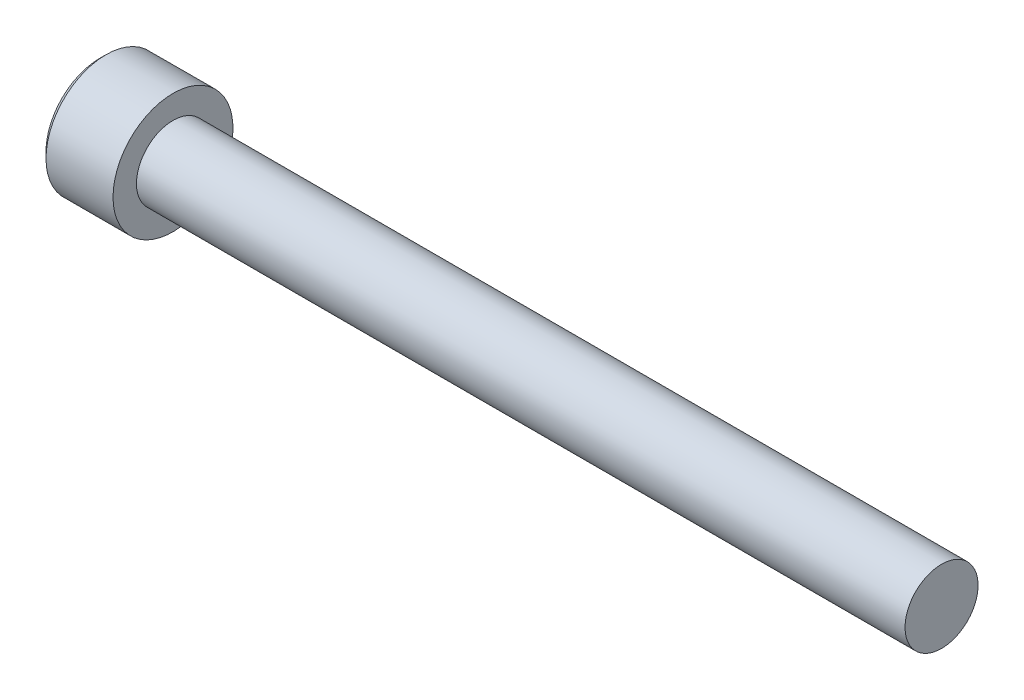
ISO-10303-21;
HEADER;
FILE_DESCRIPTION(('STEP AP214'),'2;1');
FILE_NAME('part.step','',(''),(''),'','','');
FILE_SCHEMA(('AUTOMOTIVE_DESIGN { 1 0 10303 214 1 1 1 1 }'));
ENDSEC;
DATA;
#1=APPLICATION_CONTEXT('core data for automotive mechanical design processes');
#2=APPLICATION_PROTOCOL_DEFINITION('international standard','automotive_design',2000,#1);
#3=PRODUCT_CONTEXT('',#1,'mechanical');
#4=PRODUCT('Part','Part','',(#3));
#5=PRODUCT_RELATED_PRODUCT_CATEGORY('part','',(#4));
#6=PRODUCT_DEFINITION_FORMATION('','',#4);
#7=PRODUCT_DEFINITION_CONTEXT('part definition',#1,'design');
#8=PRODUCT_DEFINITION('design','',#6,#7);
#9=PRODUCT_DEFINITION_SHAPE('','',#8);
#10=(LENGTH_UNIT() NAMED_UNIT(*) SI_UNIT(.MILLI.,.METRE.));
#11=(NAMED_UNIT(*) PLANE_ANGLE_UNIT() SI_UNIT($,.RADIAN.));
#12=(NAMED_UNIT(*) SI_UNIT($,.STERADIAN.) SOLID_ANGLE_UNIT());
#13=UNCERTAINTY_MEASURE_WITH_UNIT(LENGTH_MEASURE(1.E-05),#10,'distance_accuracy_value','');
#14=(GEOMETRIC_REPRESENTATION_CONTEXT(3) GLOBAL_UNCERTAINTY_ASSIGNED_CONTEXT((#13)) GLOBAL_UNIT_ASSIGNED_CONTEXT((#10,
#11,#12)) REPRESENTATION_CONTEXT('',''));
#15=CARTESIAN_POINT('',(0.,0.,0.));
#16=DIRECTION('',(0.,0.,1.));
#17=DIRECTION('',(1.,0.,0.));
#18=AXIS2_PLACEMENT_3D('',#15,#16,#17);
#19=CARTESIAN_POINT('',(-2.28600000000007,-1.14567944042317,1.984375));
#20=DIRECTION('',(0.,0.,1.));
#21=DIRECTION('',(1.,0.,0.));
#22=AXIS2_PLACEMENT_3D('',#19,#20,#21);
#23=PLANE('',#22);
#24=CARTESIAN_POINT('',(-4.82599999995852,1.14567944044653,1.98437499999554));
#25=CARTESIAN_POINT('',(-4.78691618362732,1.06743880343266,1.9843749999984));
#26=CARTESIAN_POINT('',(-4.75011447684892,0.987898318960917,1.98437499999957));
#27=CARTESIAN_POINT('',(-4.68265620500518,0.825677042028778,1.98437500000043));
#28=CARTESIAN_POINT('',(-4.65204056061138,0.742979382529199,1.98437500000012));
#29=CARTESIAN_POINT('',(-4.5991739228306,0.575193959555969,1.98437499999988));
#30=CARTESIAN_POINT('',(-4.57689462080725,0.490115359117279,1.98437499999997));
#31=CARTESIAN_POINT('',(-4.54259467221837,0.318093091130193,1.98437500000003));
#32=CARTESIAN_POINT('',(-4.5305423022885,0.231156054976726,1.984375));
#33=CARTESIAN_POINT('',(-4.52249110263747,0.119918521511051,1.984375));
#34=CARTESIAN_POINT('',(-4.52118947557477,0.0959468443046798,1.984375));
#35=CARTESIAN_POINT('',(-4.51945182629813,0.0479845644411998,1.984375));
#36=CARTESIAN_POINT('',(-4.51901533386223,0.0239939791589393,1.984375));
#37=CARTESIAN_POINT('',(-4.51901809008399,-0.0602201717457363,1.984375));
#38=CARTESIAN_POINT('',(-4.52177452299902,-0.120461721905447,1.984375));
#39=CARTESIAN_POINT('',(-4.5326365512493,-0.240474970989197,1.984375));
#40=CARTESIAN_POINT('',(-4.54074587749718,-0.300246312758427,1.984375));
#41=CARTESIAN_POINT('',(-4.57259622946939,-0.478763752804282,1.984375));
#42=CARTESIAN_POINT('',(-4.60385422611702,-0.596208828937734,1.984375));
#43=CARTESIAN_POINT('',(-4.66780003592237,-0.785921487441256,1.984375));
#44=CARTESIAN_POINT('',(-4.69623457768558,-0.859734609866899,1.984375));
#45=CARTESIAN_POINT('',(-4.75786140400812,-1.00456595519282,1.984375));
#46=CARTESIAN_POINT('',(-4.79100779300359,-1.07560356657101,1.984375));
#47=CARTESIAN_POINT('',(-4.82599999995643,-1.14567944044724,1.984375));
#48=B_SPLINE_CURVE_WITH_KNOTS('',3,(#24,#25,#26,#27,#28,#29,#30,#31,#32,#33,#34,#35,#36,#37,#38,
#39,#40,#41,#42,#43,#44,#45,#46,#47),.UNSPECIFIED.,.F.,.F.,(4,2,2,2,2,2,2,2,2,2,2,4),(0.,
0.262559005207405,0.526801735838036,0.790138824405318,1.05265603861765,1.12466619182083,
1.19663719499031,1.3772702672652,1.55802937209382,1.92104085090328,2.15819130092264,
2.39317265078575),.UNSPECIFIED.);
#49=CARTESIAN_POINT('',(-4.82599999996829,1.14567944041753,1.98437500003084));
#50=VERTEX_POINT('',#49);
#51=CARTESIAN_POINT('',(-4.8259999999622,-1.14567944043207,1.98437500001542));
#52=VERTEX_POINT('',#51);
#53=EDGE_CURVE('E20',#50,#52,#48,.T.);
#54=ORIENTED_EDGE('',*,*,#53,.F.);
#55=DIRECTION('',(1.,0.,0.));
#56=VECTOR('',#55,1.);
#57=CARTESIAN_POINT('',(-2.28600000000007,1.14567944042316,1.984375));
#58=LINE('',#57,#56);
#59=CARTESIAN_POINT('',(-2.28600000000007,1.14567944042316,1.984375));
#60=VERTEX_POINT('',#59);
#61=EDGE_CURVE('E68',#50,#60,#58,.T.);
#62=ORIENTED_EDGE('',*,*,#61,.T.);
#63=DIRECTION('',(0.,1.,0.));
#64=VECTOR('',#63,1.);
#65=CARTESIAN_POINT('',(-2.28600000000007,0.,1.984375));
#66=LINE('',#65,#64);
#67=CARTESIAN_POINT('',(-2.28600000000007,-1.14567944042317,1.984375));
#68=VERTEX_POINT('',#67);
#69=EDGE_CURVE('E74',#68,#60,#66,.T.);
#70=ORIENTED_EDGE('',*,*,#69,.F.);
#71=DIRECTION('',(1.,0.,0.));
#72=VECTOR('',#71,1.);
#73=CARTESIAN_POINT('',(-2.28600000000007,-1.14567944042317,1.984375));
#74=LINE('',#73,#72);
#75=EDGE_CURVE('E71',#68,#52,#74,.F.);
#76=ORIENTED_EDGE('',*,*,#75,.T.);
#77=EDGE_LOOP('',(#54,#62,#70,#76));
#78=FACE_BOUND('',#77,.T.);
#79=ADVANCED_FACE('F16',(#78),#23,.F.);
#80=CARTESIAN_POINT('',(-2.28600000000007,0.,0.));
#81=DIRECTION('',(-1.,0.,0.));
#82=DIRECTION('',(0.,0.,1.));
#83=AXIS2_PLACEMENT_3D('',#80,#81,#82);
#84=PLANE('',#83);
#85=DIRECTION('',(0.,0.5,0.866025403784439));
#86=VECTOR('',#85,1.);
#87=CARTESIAN_POINT('',(-2.28600000000007,2.29135888084633,0.));
#88=LINE('',#87,#86);
#89=CARTESIAN_POINT('',(-2.28600000000007,2.29135888084633,0.));
#90=VERTEX_POINT('',#89);
#91=CARTESIAN_POINT('',(-2.28600000000007,1.14567944042316,-1.984375));
#92=VERTEX_POINT('',#91);
#93=EDGE_CURVE('E82',#90,#92,#88,.F.);
#94=ORIENTED_EDGE('',*,*,#93,.T.);
#95=DIRECTION('',(0.,1.,0.));
#96=VECTOR('',#95,1.);
#97=CARTESIAN_POINT('',(-2.28600000000007,1.14567944042316,-1.984375));
#98=LINE('',#97,#96);
#99=CARTESIAN_POINT('',(-2.28600000000007,-1.14567944042316,-1.984375));
#100=VERTEX_POINT('',#99);
#101=EDGE_CURVE('E242',#92,#100,#98,.F.);
#102=ORIENTED_EDGE('',*,*,#101,.T.);
#103=DIRECTION('',(0.,0.5,-0.866025403784439));
#104=VECTOR('',#103,1.);
#105=CARTESIAN_POINT('',(-2.28600000000007,-1.14567944042316,-1.984375));
#106=LINE('',#105,#104);
#107=CARTESIAN_POINT('',(-2.28600000000007,-2.29135888084633,0.));
#108=VERTEX_POINT('',#107);
#109=EDGE_CURVE('E227',#100,#108,#106,.F.);
#110=ORIENTED_EDGE('',*,*,#109,.T.);
#111=DIRECTION('',(0.,-0.5,-0.866025403784439));
#112=VECTOR('',#111,1.);
#113=CARTESIAN_POINT('',(-2.28600000000007,-2.29135888084633,0.));
#114=LINE('',#113,#112);
#115=EDGE_CURVE('E224',#108,#68,#114,.F.);
#116=ORIENTED_EDGE('',*,*,#115,.T.);
#117=ORIENTED_EDGE('',*,*,#69,.T.);
#118=DIRECTION('',(0.,-0.5,0.866025403784439));
#119=VECTOR('',#118,1.);
#120=CARTESIAN_POINT('',(-2.28600000000007,1.14567944042316,1.984375));
#121=LINE('',#120,#119);
#122=EDGE_CURVE('E81',#60,#90,#121,.F.);
#123=ORIENTED_EDGE('',*,*,#122,.T.);
#124=EDGE_LOOP('',(#94,#102,#110,#116,#117,#123));
#125=FACE_BOUND('',#124,.T.);
#126=ADVANCED_FACE('F160',(#125),#84,.T.);
#127=CARTESIAN_POINT('',(-2.28600000000007,-1.14567944042316,-1.984375));
#128=DIRECTION('',(0.,-0.866025403784439,-0.5));
#129=DIRECTION('',(0.,0.5,-0.866025403784439));
#130=AXIS2_PLACEMENT_3D('',#127,#128,#129);
#131=PLANE('',#130);
#132=CARTESIAN_POINT('',(-4.82599999995871,-1.14567944040756,-1.98437500001887));
#133=CARTESIAN_POINT('',(-4.78666022792997,-1.18505700230148,-1.91617106214563));
#134=CARTESIAN_POINT('',(-4.74963132844072,-1.22509295783734,-1.8468267530301));
#135=CARTESIAN_POINT('',(-4.68183299424977,-1.30673037975396,-1.70542659047317));
#136=CARTESIAN_POINT('',(-4.65110127019237,-1.34833960561553,-1.63335729721673));
#137=CARTESIAN_POINT('',(-4.59845762010516,-1.432242568594,-1.48803310243203));
#138=CARTESIAN_POINT('',(-4.57641341195893,-1.47451494967301,-1.41481519064643));
#139=CARTESIAN_POINT('',(-4.54245011067441,-1.55999007976842,-1.26676792253773));
#140=CARTESIAN_POINT('',(-4.53050567471972,-1.6031902195197,-1.19194308559438));
#141=CARTESIAN_POINT('',(-4.51972842752365,-1.67764765054852,-1.06297903205139));
#142=CARTESIAN_POINT('',(-4.51813352794834,-1.70880881707173,-1.00900630841009));
#143=CARTESIAN_POINT('',(-4.52082392138599,-1.77108016542046,-0.901149169214274));
#144=CARTESIAN_POINT('',(-4.52511127545884,-1.80219032554946,-0.847264791239237));
#145=CARTESIAN_POINT('',(-4.53932219421538,-1.86411684097343,-0.740004920189235));
#146=CARTESIAN_POINT('',(-4.54925206045723,-1.8949328285454,-0.686630064029166));
#147=CARTESIAN_POINT('',(-4.5742029484467,-1.95603190279815,-0.580803363127978));
#148=CARTESIAN_POINT('',(-4.58922357974385,-1.98631503016081,-0.528351447923769));
#149=CARTESIAN_POINT('',(-4.63380478900425,-2.06386502548479,-0.394030915895904));
#150=CARTESIAN_POINT('',(-4.66672213384104,-2.11065153226583,-0.312994309042484));
#151=CARTESIAN_POINT('',(-4.72228952038986,-2.17944749410732,-0.193836207777459));
#152=CARTESIAN_POINT('',(-4.74181309375939,-2.20211890802843,-0.154568166986659));
#153=CARTESIAN_POINT('',(-4.78263970065987,-2.24704195201531,-0.0767591723707469));
#154=CARTESIAN_POINT('',(-4.80394164363173,-2.2692938292399,-0.0382177904539708));
#155=CARTESIAN_POINT('',(-4.82599999995675,-2.29135888085868,2.13931096265935E-11));
#156=B_SPLINE_CURVE_WITH_KNOTS('',3,(#132,#133,#134,#135,#136,#137,#138,#139,#140,#141,#142,
#143,#144,#145,#146,#147,#148,#149,#150,#151,#152,#153,#154,#155),.UNSPECIFIED.,.F.,.F.,(4,2,2,
2,2,2,2,2,2,2,2,4),(0.,0.264284909626495,0.530108996358094,0.791712695414128,1.05265800174404,
1.23942150116703,1.42625045663858,1.61328847394198,1.80031214908683,2.09727151182814,
2.24534838946042,2.39333511890876),.UNSPECIFIED.);
#157=CARTESIAN_POINT('',(-4.8259999999622,-1.14567944043207,-1.98437500001542));
#158=VERTEX_POINT('',#157);
#159=CARTESIAN_POINT('',(-4.82599999996846,-2.2913588808704,-2.00043543490866E-11));
#160=VERTEX_POINT('',#159);
#161=EDGE_CURVE('E162',#158,#160,#156,.T.);
#162=ORIENTED_EDGE('',*,*,#161,.T.);
#163=DIRECTION('',(1.,0.,0.));
#164=VECTOR('',#163,1.);
#165=CARTESIAN_POINT('',(-2.28600000000007,-2.29135888084633,0.));
#166=LINE('',#165,#164);
#167=EDGE_CURVE('E235',#160,#108,#166,.T.);
#168=ORIENTED_EDGE('',*,*,#167,.T.);
#169=ORIENTED_EDGE('',*,*,#109,.F.);
#170=DIRECTION('',(-1.,0.,0.));
#171=VECTOR('',#170,1.);
#172=CARTESIAN_POINT('',(-2.28600000000007,-1.14567944042316,-1.984375));
#173=LINE('',#172,#171);
#174=EDGE_CURVE('E245',#100,#158,#173,.T.);
#175=ORIENTED_EDGE('',*,*,#174,.T.);
#176=EDGE_LOOP('',(#162,#168,#169,#175));
#177=FACE_BOUND('',#176,.T.);
#178=ADVANCED_FACE('F156',(#177),#131,.F.);
#179=CARTESIAN_POINT('',(-2.28600000000007,-2.29135888084633,0.));
#180=DIRECTION('',(0.,-0.866025403784439,0.5));
#181=DIRECTION('',(0.,-0.5,-0.866025403784439));
#182=AXIS2_PLACEMENT_3D('',#179,#180,#181);
#183=PLANE('',#182);
#184=CARTESIAN_POINT('',(-4.8259999999587,-2.29135888085486,-2.29477011545215E-11));
#185=CARTESIAN_POINT('',(-4.78666022792997,-2.25198131896546,0.0682039378529047));
#186=CARTESIAN_POINT('',(-4.74963132844072,-2.21194536343147,0.137548246969502));
#187=CARTESIAN_POINT('',(-4.68183299424977,-2.13030794151622,0.278948409527228));
#188=CARTESIAN_POINT('',(-4.65110127019237,-2.08869871565414,0.351017702783377));
#189=CARTESIAN_POINT('',(-4.59845762010516,-2.00479575267531,0.496341897567867));
#190=CARTESIAN_POINT('',(-4.57641341195893,-1.96252337159644,0.569559809353539));
#191=CARTESIAN_POINT('',(-4.5424501106744,-1.87704824150112,0.717607077462299));
#192=CARTESIAN_POINT('',(-4.53050567471972,-1.8338481017498,0.792431914405622));
#193=CARTESIAN_POINT('',(-4.51972842752365,-1.75939067072096,0.921395967948603));
#194=CARTESIAN_POINT('',(-4.51813352794834,-1.72822950419776,0.975368691589913));
#195=CARTESIAN_POINT('',(-4.52082392138599,-1.66595815584903,1.08322583078573));
#196=CARTESIAN_POINT('',(-4.52511127545884,-1.63484799572003,1.13711020876076));
#197=CARTESIAN_POINT('',(-4.53932219421538,-1.57292148029607,1.24437007981077));
#198=CARTESIAN_POINT('',(-4.54925206045723,-1.54210549272409,1.29774493597084));
#199=CARTESIAN_POINT('',(-4.5742029484467,-1.48100641847134,1.40357163687202));
#200=CARTESIAN_POINT('',(-4.58922357974385,-1.45072329110868,1.45602355207623));
#201=CARTESIAN_POINT('',(-4.63380478900421,-1.37317329578476,1.59034408410398));
#202=CARTESIAN_POINT('',(-4.66672213384095,-1.32638678900379,1.6713806909573));
#203=CARTESIAN_POINT('',(-4.72228952038968,-1.25759082716239,1.79053879222216));
#204=CARTESIAN_POINT('',(-4.74181309375917,-1.23491941324131,1.82980683301291));
#205=CARTESIAN_POINT('',(-4.78263970065959,-1.18999636925449,1.90761582762873));
#206=CARTESIAN_POINT('',(-4.8039416436314,-1.16774449202993,1.94615720954545));
#207=CARTESIAN_POINT('',(-4.82599999995639,-1.14567944041117,1.98437500002077));
#208=B_SPLINE_CURVE_WITH_KNOTS('',3,(#184,#185,#186,#187,#188,#189,#190,#191,#192,#193,#194,
#195,#196,#197,#198,#199,#200,#201,#202,#203,#204,#205,#206,#207),.UNSPECIFIED.,.F.,.F.,(4,2,2,
2,2,2,2,2,2,2,2,4),(0.,0.264284909626493,0.530108996358089,0.791712695414125,1.05265800174404,
1.23942150116703,1.42625045663858,1.61328847394198,1.80031214908683,2.09727151182773,
2.24534838945981,2.39333511890795),.UNSPECIFIED.);
#209=EDGE_CURVE('E91',#160,#52,#208,.T.);
#210=ORIENTED_EDGE('',*,*,#209,.T.);
#211=ORIENTED_EDGE('',*,*,#75,.F.);
#212=ORIENTED_EDGE('',*,*,#115,.F.);
#213=ORIENTED_EDGE('',*,*,#167,.F.);
#214=EDGE_LOOP('',(#210,#211,#212,#213));
#215=FACE_BOUND('',#214,.T.);
#216=ADVANCED_FACE('F151',(#215),#183,.F.);
#217=CARTESIAN_POINT('',(-2.28600000000007,1.14567944042316,1.984375));
#218=DIRECTION('',(0.,0.866025403784439,0.5));
#219=DIRECTION('',(0.,-0.5,0.866025403784439));
#220=AXIS2_PLACEMENT_3D('',#217,#218,#219);
#221=PLANE('',#220);
#222=CARTESIAN_POINT('',(-4.82599999995852,1.14567944040762,1.98437500001801));
#223=CARTESIAN_POINT('',(-4.78666022792973,1.1850570023017,1.91617106214498));
#224=CARTESIAN_POINT('',(-4.74963132844047,1.22509295783761,1.84682675302957));
#225=CARTESIAN_POINT('',(-4.68183299424957,1.30673037975422,1.70542659047278));
#226=CARTESIAN_POINT('',(-4.65110127019222,1.34833960561574,1.63335729721638));
#227=CARTESIAN_POINT('',(-4.59845762010509,1.43224256859413,1.48803310243178));
#228=CARTESIAN_POINT('',(-4.57641341195888,1.47451494967311,1.41481519064625));
#229=CARTESIAN_POINT('',(-4.54245011067439,1.55999007976846,1.26676792253767));
#230=CARTESIAN_POINT('',(-4.53050567471972,1.6031902195197,1.19194308559439));
#231=CARTESIAN_POINT('',(-4.51972842752365,1.67764765054848,1.06297903205146));
#232=CARTESIAN_POINT('',(-4.51813352794835,1.70880881707169,1.00900630841016));
#233=CARTESIAN_POINT('',(-4.52082392138598,1.77108016542041,0.901149169214364));
#234=CARTESIAN_POINT('',(-4.52511127545883,1.80219032554941,0.847264791239333));
#235=CARTESIAN_POINT('',(-4.53932219421536,1.86411684097336,0.740004920189342));
#236=CARTESIAN_POINT('',(-4.54925206045721,1.89493282854533,0.686630064029278));
#237=CARTESIAN_POINT('',(-4.57420294844667,1.95603190279808,0.5808033631281));
#238=CARTESIAN_POINT('',(-4.58922357974382,1.98631503016074,0.528351447923897));
#239=CARTESIAN_POINT('',(-4.6338047890042,2.06386502548473,0.394030915896012));
#240=CARTESIAN_POINT('',(-4.666722133841,2.11065153226578,0.312994309042568));
#241=CARTESIAN_POINT('',(-4.72228952038984,2.17944749410729,0.19383620777751));
#242=CARTESIAN_POINT('',(-4.74181309375937,2.20211890802841,0.1545681669867));
#243=CARTESIAN_POINT('',(-4.78263970065986,2.24704195201529,0.0767591723707674));
#244=CARTESIAN_POINT('',(-4.80394164363172,2.26929382923989,0.0382177904539813));
#245=CARTESIAN_POINT('',(-4.82599999995675,2.29135888085868,-2.1392886942985E-11));
#246=B_SPLINE_CURVE_WITH_KNOTS('',3,(#222,#223,#224,#225,#226,#227,#228,#229,#230,#231,#232,
#233,#234,#235,#236,#237,#238,#239,#240,#241,#242,#243,#244,#245),.UNSPECIFIED.,.F.,.F.,(4,2,2,
2,2,2,2,2,2,2,2,4),(0.,0.26428490962629,0.530108996357672,0.791712695413487,1.05265800174319,
1.23942150116616,1.42625045663768,1.61328847394106,1.80031214908589,2.09727151182728,
2.2453483894596,2.39333511890798),.UNSPECIFIED.);
#247=CARTESIAN_POINT('',(-4.82599999996846,2.29135888087039,2.00042061038936E-11));
#248=VERTEX_POINT('',#247);
#249=EDGE_CURVE('E79',#50,#248,#246,.T.);
#250=ORIENTED_EDGE('',*,*,#249,.T.);
#251=DIRECTION('',(1.,0.,0.));
#252=VECTOR('',#251,1.);
#253=CARTESIAN_POINT('',(-2.28600000000007,2.29135888084633,0.));
#254=LINE('',#253,#252);
#255=EDGE_CURVE('E246',#248,#90,#254,.T.);
#256=ORIENTED_EDGE('',*,*,#255,.T.);
#257=ORIENTED_EDGE('',*,*,#122,.F.);
#258=ORIENTED_EDGE('',*,*,#61,.F.);
#259=EDGE_LOOP('',(#250,#256,#257,#258));
#260=FACE_BOUND('',#259,.T.);
#261=ADVANCED_FACE('F76',(#260),#221,.F.);
#262=CARTESIAN_POINT('',(-2.28600000000007,2.29135888084633,0.));
#263=DIRECTION('',(0.,0.866025403784439,-0.5));
#264=DIRECTION('',(0.,0.5,0.866025403784439));
#265=AXIS2_PLACEMENT_3D('',#262,#263,#264);
#266=PLANE('',#265);
#267=CARTESIAN_POINT('',(-4.82599999995871,2.29135888085486,2.29489280696874E-11));
#268=CARTESIAN_POINT('',(-4.78666022792997,2.25198131896547,-0.0682039378529039));
#269=CARTESIAN_POINT('',(-4.74963132844072,2.21194536343147,-0.137548246969502));
#270=CARTESIAN_POINT('',(-4.68183299424977,2.13030794151622,-0.278948409527229));
#271=CARTESIAN_POINT('',(-4.65110127019237,2.08869871565414,-0.351017702783379));
#272=CARTESIAN_POINT('',(-4.59845762010516,2.00479575267531,-0.496341897567869));
#273=CARTESIAN_POINT('',(-4.57641341195893,1.96252337159644,-0.569559809353541));
#274=CARTESIAN_POINT('',(-4.5424501106744,1.87704824150112,-0.7176070774623));
#275=CARTESIAN_POINT('',(-4.53050567471972,1.8338481017498,-0.792431914405622));
#276=CARTESIAN_POINT('',(-4.51972842752365,1.75939067072096,-0.921395967948603));
#277=CARTESIAN_POINT('',(-4.51813352794834,1.72822950419776,-0.975368691589912));
#278=CARTESIAN_POINT('',(-4.52082392138599,1.66595815584903,-1.08322583078573));
#279=CARTESIAN_POINT('',(-4.52511127545884,1.63484799572003,-1.13711020876076));
#280=CARTESIAN_POINT('',(-4.53932219421538,1.57292148029607,-1.24437007981077));
#281=CARTESIAN_POINT('',(-4.54925206045723,1.54210549272409,-1.29774493597083));
#282=CARTESIAN_POINT('',(-4.5742029484467,1.48100641847134,-1.40357163687202));
#283=CARTESIAN_POINT('',(-4.58922357974385,1.45072329110868,-1.45602355207623));
#284=CARTESIAN_POINT('',(-4.63380478900425,1.3731732957847,-1.5903440841041));
#285=CARTESIAN_POINT('',(-4.66672213384104,1.32638678900366,-1.67138069095752));
#286=CARTESIAN_POINT('',(-4.72228952038986,1.25759082716218,-1.79053879222254));
#287=CARTESIAN_POINT('',(-4.74181309375939,1.23491941324106,-1.82980683301334));
#288=CARTESIAN_POINT('',(-4.78263970065987,1.18999636925419,-1.90761582762925));
#289=CARTESIAN_POINT('',(-4.80394164363173,1.1677444920296,-1.94615720954603));
#290=CARTESIAN_POINT('',(-4.82599999995675,1.14567944041081,-1.98437500002139));
#291=B_SPLINE_CURVE_WITH_KNOTS('',3,(#267,#268,#269,#270,#271,#272,#273,#274,#275,#276,#277,
#278,#279,#280,#281,#282,#283,#284,#285,#286,#287,#288,#289,#290),.UNSPECIFIED.,.F.,.F.,(4,2,2,
2,2,2,2,2,2,2,2,4),(0.,0.264284909626495,0.530108996358093,0.791712695414127,1.05265800174404,
1.23942150116703,1.42625045663858,1.61328847394198,1.80031214908683,2.09727151182814,
2.24534838946042,2.39333511890876),.UNSPECIFIED.);
#292=CARTESIAN_POINT('',(-4.82599999996846,1.14567944045252,-1.98437500001084));
#293=VERTEX_POINT('',#292);
#294=EDGE_CURVE('E39',#248,#293,#291,.T.);
#295=ORIENTED_EDGE('',*,*,#294,.T.);
#296=DIRECTION('',(-1.,0.,0.));
#297=VECTOR('',#296,1.);
#298=CARTESIAN_POINT('',(-2.28600000000007,1.14567944042316,-1.984375));
#299=LINE('',#298,#297);
#300=EDGE_CURVE('E166',#293,#92,#299,.F.);
#301=ORIENTED_EDGE('',*,*,#300,.T.);
#302=ORIENTED_EDGE('',*,*,#93,.F.);
#303=ORIENTED_EDGE('',*,*,#255,.F.);
#304=EDGE_LOOP('',(#295,#301,#302,#303));
#305=FACE_BOUND('',#304,.T.);
#306=ADVANCED_FACE('F150',(#305),#266,.F.);
#307=CARTESIAN_POINT('',(-2.28600000000007,1.14567944042316,-1.984375));
#308=DIRECTION('',(0.,0.,-1.));
#309=DIRECTION('',(-1.,0.,0.));
#310=AXIS2_PLACEMENT_3D('',#307,#308,#309);
#311=PLANE('',#310);
#312=CARTESIAN_POINT('',(-4.8259999999587,1.14567944044731,-1.98437499999592));
#313=CARTESIAN_POINT('',(-4.78666022793094,1.06692431665146,-1.98437499999853));
#314=CARTESIAN_POINT('',(-4.74963132844318,0.986852405569011,-1.98437499999961));
#315=CARTESIAN_POINT('',(-4.6818329942566,0.823577561711963,-1.9843750000004));
#316=CARTESIAN_POINT('',(-4.65110127020207,0.740359109975722,-1.98437500000011));
#317=CARTESIAN_POINT('',(-4.59845762012233,0.572553183993917,-1.9843749999999));
#318=CARTESIAN_POINT('',(-4.57641341198063,0.488008421824127,-1.98437499999997));
#319=CARTESIAN_POINT('',(-4.54245011070673,0.317058161610178,-1.98437500000003));
#320=CARTESIAN_POINT('',(-4.53050567475816,0.230657882096267,-1.98437500000001));
#321=CARTESIAN_POINT('',(-4.51972842757294,0.0817430200124032,-1.984375));
#322=CARTESIAN_POINT('',(-4.51813352800283,0.0194206869508218,-1.984375));
#323=CARTESIAN_POINT('',(-4.52082392145254,-0.1051220097764,-1.984375));
#324=CARTESIAN_POINT('',(-4.52511127553227,-0.167342330049008,-1.984375));
#325=CARTESIAN_POINT('',(-4.53932219430377,-0.291195360925477,-1.984375));
#326=CARTESIAN_POINT('',(-4.54925206055372,-0.352827336083362,-1.984375));
#327=CARTESIAN_POINT('',(-4.57420294856008,-0.475025484616114,-1.984375));
#328=CARTESIAN_POINT('',(-4.58922357986604,-0.535591739354747,-1.984375));
#329=CARTESIAN_POINT('',(-4.63380478912724,-0.690691729958653,-1.984375));
#330=CARTESIAN_POINT('',(-4.66672213394715,-0.784264743465576,-1.984375));
#331=CARTESIAN_POINT('',(-4.7222895204619,-0.921856667069616,-1.984375));
#332=CARTESIAN_POINT('',(-4.74181309381856,-0.967199494886089,-1.984375));
#333=CARTESIAN_POINT('',(-4.78263970069104,-1.05704558280959,-1.984375));
#334=CARTESIAN_POINT('',(-4.80394164364776,-1.10154933723428,-1.984375));
#335=CARTESIAN_POINT('',(-4.82599999995675,-1.14567944044787,-1.984375));
#336=B_SPLINE_CURVE_WITH_KNOTS('',3,(#312,#313,#314,#315,#316,#317,#318,#319,#320,#321,#322,
#323,#324,#325,#326,#327,#328,#329,#330,#331,#332,#333,#334,#335),.UNSPECIFIED.,.F.,.F.,(4,2,2,
2,2,2,2,2,2,2,2,4),(0.,0.264284909658836,0.530108996422784,0.791712695509868,1.0526580018708,
1.23942150133878,1.42625045685537,1.61328847420389,1.80031214939384,2.09727151196384,
2.24534838950992,2.39333511887245),.UNSPECIFIED.);
#337=EDGE_CURVE('E108',#293,#158,#336,.T.);
#338=ORIENTED_EDGE('',*,*,#337,.T.);
#339=ORIENTED_EDGE('',*,*,#174,.F.);
#340=ORIENTED_EDGE('',*,*,#101,.F.);
#341=ORIENTED_EDGE('',*,*,#300,.F.);
#342=EDGE_LOOP('',(#338,#339,#340,#341));
#343=FACE_BOUND('',#342,.T.);
#344=ADVANCED_FACE('F121',(#343),#311,.F.);
#345=CARTESIAN_POINT('',(-4.82599999998001,0.,0.));
#346=DIRECTION('',(-1.,0.,0.));
#347=DIRECTION('',(0.,0.,1.));
#348=AXIS2_PLACEMENT_3D('',#345,#346,#347);
#349=CONICAL_SURFACE('',#348,2.29135888088194,0.785398163397448);
#350=ORIENTED_EDGE('',*,*,#161,.F.);
#351=CARTESIAN_POINT('',(-4.82599999998001,0.,0.));
#352=DIRECTION('',(-1.,0.,0.));
#353=DIRECTION('',(0.,0.,1.));
#354=AXIS2_PLACEMENT_3D('',#351,#352,#353);
#355=CIRCLE('',#354,2.29135888088194);
#356=EDGE_CURVE('E105',#158,#160,#355,.T.);
#357=ORIENTED_EDGE('',*,*,#356,.T.);
#358=EDGE_LOOP('',(#350,#357));
#359=FACE_BOUND('',#358,.T.);
#360=ADVANCED_FACE('F167',(#359),#349,.F.);
#361=CARTESIAN_POINT('',(-4.82599999998001,0.,0.));
#362=DIRECTION('',(-1.,0.,0.));
#363=DIRECTION('',(0.,0.,1.));
#364=AXIS2_PLACEMENT_3D('',#361,#362,#363);
#365=CONICAL_SURFACE('',#364,2.29135888088194,0.785398163397448);
#366=ORIENTED_EDGE('',*,*,#209,.F.);
#367=CARTESIAN_POINT('',(-4.82599999998001,0.,0.));
#368=DIRECTION('',(-1.,0.,0.));
#369=DIRECTION('',(0.,0.,1.));
#370=AXIS2_PLACEMENT_3D('',#367,#368,#369);
#371=CIRCLE('',#370,2.29135888088194);
#372=EDGE_CURVE('E86',#160,#52,#371,.T.);
#373=ORIENTED_EDGE('',*,*,#372,.T.);
#374=EDGE_LOOP('',(#366,#373));
#375=FACE_BOUND('',#374,.T.);
#376=ADVANCED_FACE('F170',(#375),#365,.F.);
#377=CARTESIAN_POINT('',(-4.82599999998001,0.,0.));
#378=DIRECTION('',(-1.,0.,0.));
#379=DIRECTION('',(0.,0.,1.));
#380=AXIS2_PLACEMENT_3D('',#377,#378,#379);
#381=CONICAL_SURFACE('',#380,2.29135888088194,0.78539816348948);
#382=CARTESIAN_POINT('',(-4.82599999998001,0.,0.));
#383=DIRECTION('',(-1.,0.,0.));
#384=DIRECTION('',(0.,0.,1.));
#385=AXIS2_PLACEMENT_3D('',#382,#383,#384);
#386=CIRCLE('',#385,2.29135888088194);
#387=EDGE_CURVE('E59',#52,#50,#386,.T.);
#388=ORIENTED_EDGE('',*,*,#387,.T.);
#389=ORIENTED_EDGE('',*,*,#53,.T.);
#390=EDGE_LOOP('',(#388,#389));
#391=FACE_BOUND('',#390,.T.);
#392=ADVANCED_FACE('F84',(#391),#381,.F.);
#393=CARTESIAN_POINT('',(-4.82599999998001,0.,0.));
#394=DIRECTION('',(-1.,0.,0.));
#395=DIRECTION('',(0.,0.,1.));
#396=AXIS2_PLACEMENT_3D('',#393,#394,#395);
#397=CONICAL_SURFACE('',#396,2.29135888088194,0.785398163397448);
#398=ORIENTED_EDGE('',*,*,#249,.F.);
#399=CARTESIAN_POINT('',(-4.82599999998001,0.,0.));
#400=DIRECTION('',(-1.,0.,0.));
#401=DIRECTION('',(0.,0.,1.));
#402=AXIS2_PLACEMENT_3D('',#399,#400,#401);
#403=CIRCLE('',#402,2.29135888088194);
#404=EDGE_CURVE('E85',#50,#248,#403,.T.);
#405=ORIENTED_EDGE('',*,*,#404,.T.);
#406=EDGE_LOOP('',(#398,#405));
#407=FACE_BOUND('',#406,.T.);
#408=ADVANCED_FACE('F90',(#407),#397,.F.);
#409=CARTESIAN_POINT('',(-4.82599999998001,0.,0.));
#410=DIRECTION('',(-1.,0.,0.));
#411=DIRECTION('',(0.,0.,1.));
#412=AXIS2_PLACEMENT_3D('',#409,#410,#411);
#413=CONICAL_SURFACE('',#412,2.29135888088194,0.785398163397448);
#414=ORIENTED_EDGE('',*,*,#294,.F.);
#415=CARTESIAN_POINT('',(-4.82599999998001,0.,0.));
#416=DIRECTION('',(-1.,0.,0.));
#417=DIRECTION('',(0.,0.,1.));
#418=AXIS2_PLACEMENT_3D('',#415,#416,#417);
#419=CIRCLE('',#418,2.29135888088194);
#420=EDGE_CURVE('E97',#248,#293,#419,.T.);
#421=ORIENTED_EDGE('',*,*,#420,.T.);
#422=EDGE_LOOP('',(#414,#421));
#423=FACE_BOUND('',#422,.T.);
#424=ADVANCED_FACE('F128',(#423),#413,.F.);
#425=CARTESIAN_POINT('',(-4.82599999998001,0.,0.));
#426=DIRECTION('',(-1.,0.,0.));
#427=DIRECTION('',(0.,0.,1.));
#428=AXIS2_PLACEMENT_3D('',#425,#426,#427);
#429=CONICAL_SURFACE('',#428,2.29135888088194,0.785398163489476);
#430=ORIENTED_EDGE('',*,*,#337,.F.);
#431=CARTESIAN_POINT('',(-4.82599999998001,0.,0.));
#432=DIRECTION('',(-1.,0.,0.));
#433=DIRECTION('',(0.,0.,1.));
#434=AXIS2_PLACEMENT_3D('',#431,#432,#433);
#435=CIRCLE('',#434,2.29135888088194);
#436=EDGE_CURVE('E99',#293,#158,#435,.T.);
#437=ORIENTED_EDGE('',*,*,#436,.T.);
#438=EDGE_LOOP('',(#430,#437));
#439=FACE_BOUND('',#438,.T.);
#440=ADVANCED_FACE('F124',(#439),#429,.F.);
#441=CARTESIAN_POINT('',(-4.82600000000007,0.,0.));
#442=DIRECTION('',(1.,0.,0.));
#443=DIRECTION('',(0.,0.,-1.));
#444=AXIS2_PLACEMENT_3D('',#441,#442,#443);
#445=PLANE('',#444);
#446=CARTESIAN_POINT('',(-4.82599999998001,0.,0.));
#447=DIRECTION('',(1.,0.,0.));
#448=DIRECTION('',(0.,0.,-1.));
#449=AXIS2_PLACEMENT_3D('',#446,#447,#448);
#450=CIRCLE('',#449,3.56615999999121);
#451=CARTESIAN_POINT('',(-4.82599999998001,0.,-3.56615999999121));
#452=VERTEX_POINT('',#451);
#453=EDGE_CURVE('E212',#452,#452,#450,.T.);
#454=ORIENTED_EDGE('',*,*,#453,.F.);
#455=EDGE_LOOP('',(#454));
#456=FACE_BOUND('',#455,.T.);
#457=ORIENTED_EDGE('',*,*,#420,.F.);
#458=ORIENTED_EDGE('',*,*,#404,.F.);
#459=ORIENTED_EDGE('',*,*,#387,.F.);
#460=ORIENTED_EDGE('',*,*,#372,.F.);
#461=ORIENTED_EDGE('',*,*,#356,.F.);
#462=ORIENTED_EDGE('',*,*,#436,.F.);
#463=EDGE_LOOP('',(#457,#458,#459,#460,#461,#462));
#464=FACE_BOUND('',#463,.T.);
#465=ADVANCED_FACE('F94',(#456,#464),#445,.F.);
#466=CARTESIAN_POINT('',(-4.42976000010731,0.,0.));
#467=DIRECTION('',(1.,0.,0.));
#468=DIRECTION('',(0.,0.,-1.));
#469=AXIS2_PLACEMENT_3D('',#466,#467,#468);
#470=CONICAL_SURFACE('',#469,3.96239999986392,0.785398163397448);
#471=CARTESIAN_POINT('',(-4.42976000000007,0.,0.));
#472=DIRECTION('',(-1.,0.,0.));
#473=DIRECTION('',(0.,0.,1.));
#474=AXIS2_PLACEMENT_3D('',#471,#472,#473);
#475=CIRCLE('',#474,3.9624);
#476=CARTESIAN_POINT('',(-4.42976000000007,0.,3.9624));
#477=VERTEX_POINT('',#476);
#478=EDGE_CURVE('E209',#477,#477,#475,.F.);
#479=ORIENTED_EDGE('',*,*,#478,.F.);
#480=EDGE_LOOP('',(#479));
#481=FACE_BOUND('',#480,.T.);
#482=ORIENTED_EDGE('',*,*,#453,.T.);
#483=EDGE_LOOP('',(#482));
#484=FACE_BOUND('',#483,.T.);
#485=ADVANCED_FACE('F198',(#481,#484),#470,.T.);
#486=CARTESIAN_POINT('',(-4.82600000000008,0.,0.));
#487=DIRECTION('',(-1.,0.,0.));
#488=DIRECTION('',(0.,0.,1.));
#489=AXIS2_PLACEMENT_3D('',#486,#487,#488);
#490=CYLINDRICAL_SURFACE('',#489,3.9624);
#491=ORIENTED_EDGE('',*,*,#478,.T.);
#492=EDGE_LOOP('',(#491));
#493=FACE_BOUND('',#492,.T.);
#494=CARTESIAN_POINT('',(0.,0.,0.));
#495=DIRECTION('',(-1.,0.,0.));
#496=DIRECTION('',(0.,0.,1.));
#497=AXIS2_PLACEMENT_3D('',#494,#495,#496);
#498=CIRCLE('',#497,3.9624);
#499=CARTESIAN_POINT('',(0.,0.,3.9624));
#500=VERTEX_POINT('',#499);
#501=EDGE_CURVE('E214',#500,#500,#498,.T.);
#502=ORIENTED_EDGE('',*,*,#501,.T.);
#503=EDGE_LOOP('',(#502));
#504=FACE_BOUND('',#503,.T.);
#505=ADVANCED_FACE('F195',(#493,#504),#490,.T.);
#506=CARTESIAN_POINT('',(50.8,0.,0.));
#507=DIRECTION('',(1.,0.,0.));
#508=DIRECTION('',(0.,0.,-1.));
#509=AXIS2_PLACEMENT_3D('',#506,#507,#508);
#510=PLANE('',#509);
#511=CARTESIAN_POINT('',(50.8,0.,0.));
#512=DIRECTION('',(-1.,0.,0.));
#513=DIRECTION('',(0.,0.,1.));
#514=AXIS2_PLACEMENT_3D('',#511,#512,#513);
#515=CIRCLE('',#514,2.413);
#516=CARTESIAN_POINT('',(50.8,0.,2.413));
#517=VERTEX_POINT('',#516);
#518=EDGE_CURVE('E30',#517,#517,#515,.T.);
#519=ORIENTED_EDGE('',*,*,#518,.F.);
#520=EDGE_LOOP('',(#519));
#521=FACE_BOUND('',#520,.T.);
#522=ADVANCED_FACE('F188',(#521),#510,.T.);
#523=CARTESIAN_POINT('',(0.,3.9624,0.));
#524=DIRECTION('',(-1.,0.,0.));
#525=DIRECTION('',(0.,0.,1.));
#526=AXIS2_PLACEMENT_3D('',#523,#524,#525);
#527=PLANE('',#526);
#528=CARTESIAN_POINT('',(0.,0.,0.));
#529=DIRECTION('',(-1.,0.,0.));
#530=DIRECTION('',(0.,0.,1.));
#531=AXIS2_PLACEMENT_3D('',#528,#529,#530);
#532=CIRCLE('',#531,2.413);
#533=CARTESIAN_POINT('',(0.,0.,2.413));
#534=VERTEX_POINT('',#533);
#535=EDGE_CURVE('E11',#534,#534,#532,.F.);
#536=ORIENTED_EDGE('',*,*,#535,.F.);
#537=EDGE_LOOP('',(#536));
#538=FACE_BOUND('',#537,.T.);
#539=ORIENTED_EDGE('',*,*,#501,.F.);
#540=EDGE_LOOP('',(#539));
#541=FACE_BOUND('',#540,.T.);
#542=ADVANCED_FACE('F182',(#538,#541),#527,.F.);
#543=CARTESIAN_POINT('',(50.8,0.,0.));
#544=DIRECTION('',(-1.,0.,0.));
#545=DIRECTION('',(0.,0.,1.));
#546=AXIS2_PLACEMENT_3D('',#543,#544,#545);
#547=CYLINDRICAL_SURFACE('',#546,2.413);
#548=ORIENTED_EDGE('',*,*,#535,.T.);
#549=EDGE_LOOP('',(#548));
#550=FACE_BOUND('',#549,.T.);
#551=ORIENTED_EDGE('',*,*,#518,.T.);
#552=EDGE_LOOP('',(#551));
#553=FACE_BOUND('',#552,.T.);
#554=ADVANCED_FACE('F180',(#550,#553),#547,.T.);
#555=CLOSED_SHELL('',(#79,#126,#178,#216,#261,#306,#344,#360,#376,#392,#408,#424,#440,#465,#485,
#505,#522,#542,#554));
#556=MANIFOLD_SOLID_BREP('B1',#555);
#557=ADVANCED_BREP_SHAPE_REPRESENTATION('',(#18,#556),#14);
#558=SHAPE_DEFINITION_REPRESENTATION(#9,#557);
ENDSEC;
END-ISO-10303-21;
